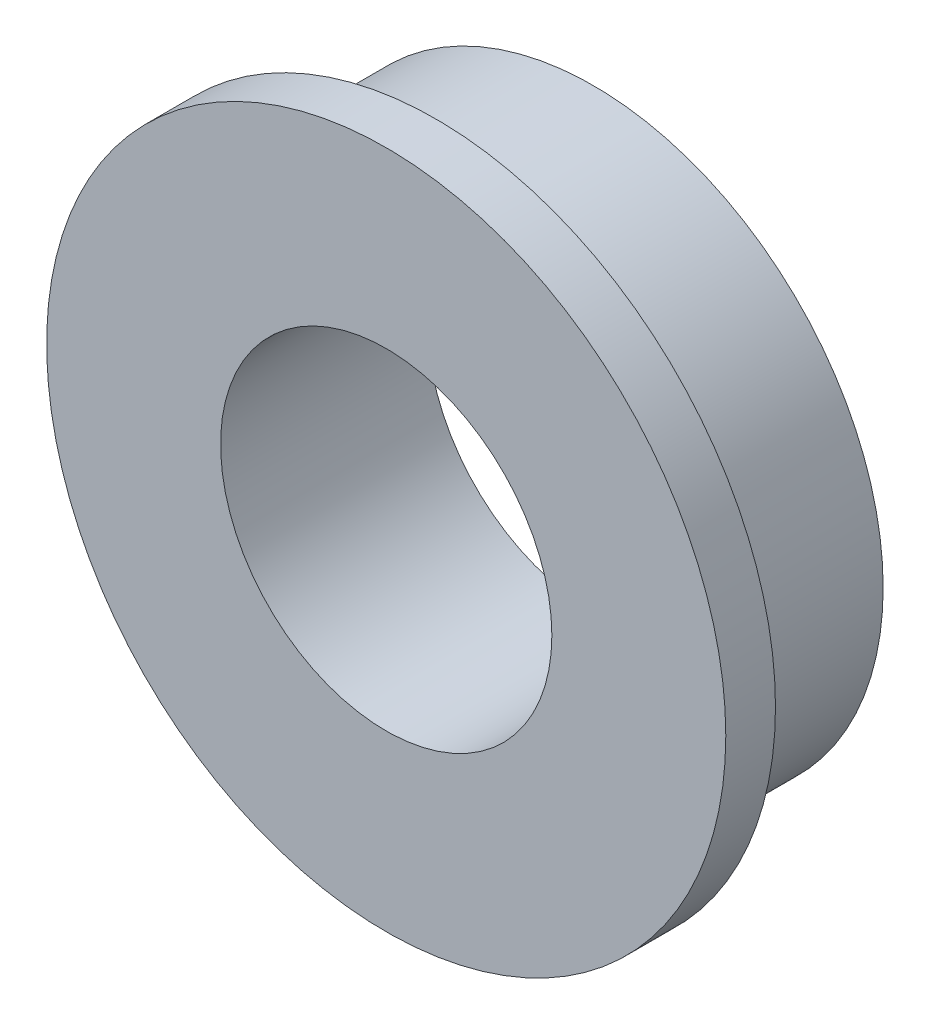
ISO-10303-21;
HEADER;
FILE_DESCRIPTION(('STEP AP214'),'2;1');
FILE_NAME('part.step','',(''),(''),'','','');
FILE_SCHEMA(('AUTOMOTIVE_DESIGN { 1 0 10303 214 1 1 1 1 }'));
ENDSEC;
DATA;
#1=APPLICATION_CONTEXT('core data for automotive mechanical design processes');
#2=APPLICATION_PROTOCOL_DEFINITION('international standard','automotive_design',2000,#1);
#3=PRODUCT_CONTEXT('',#1,'mechanical');
#4=PRODUCT('Part','Part','',(#3));
#5=PRODUCT_RELATED_PRODUCT_CATEGORY('part','',(#4));
#6=PRODUCT_DEFINITION_FORMATION('','',#4);
#7=PRODUCT_DEFINITION_CONTEXT('part definition',#1,'design');
#8=PRODUCT_DEFINITION('design','',#6,#7);
#9=PRODUCT_DEFINITION_SHAPE('','',#8);
#10=(LENGTH_UNIT() NAMED_UNIT(*) SI_UNIT(.MILLI.,.METRE.));
#11=(NAMED_UNIT(*) PLANE_ANGLE_UNIT() SI_UNIT($,.RADIAN.));
#12=(NAMED_UNIT(*) SI_UNIT($,.STERADIAN.) SOLID_ANGLE_UNIT());
#13=UNCERTAINTY_MEASURE_WITH_UNIT(LENGTH_MEASURE(1.E-05),#10,'distance_accuracy_value','');
#14=(GEOMETRIC_REPRESENTATION_CONTEXT(3) GLOBAL_UNCERTAINTY_ASSIGNED_CONTEXT((#13)) GLOBAL_UNIT_ASSIGNED_CONTEXT((#10,
#11,#12)) REPRESENTATION_CONTEXT('',''));
#15=CARTESIAN_POINT('',(0.,0.,0.));
#16=DIRECTION('',(0.,0.,1.));
#17=DIRECTION('',(1.,0.,0.));
#18=AXIS2_PLACEMENT_3D('',#15,#16,#17);
#19=CARTESIAN_POINT('',(0.,0.,0.));
#20=DIRECTION('',(0.,0.,1.));
#21=DIRECTION('',(1.,0.,0.));
#22=AXIS2_PLACEMENT_3D('',#19,#20,#21);
#23=PLANE('',#22);
#24=CARTESIAN_POINT('',(0.,0.,0.));
#25=DIRECTION('',(0.,0.,1.));
#26=DIRECTION('',(1.,0.,0.));
#27=AXIS2_PLACEMENT_3D('',#24,#25,#26);
#28=CIRCLE('',#27,3.5);
#29=CARTESIAN_POINT('',(3.5,0.,0.));
#30=VERTEX_POINT('',#29);
#31=EDGE_CURVE('E37',#30,#30,#28,.T.);
#32=ORIENTED_EDGE('',*,*,#31,.F.);
#33=EDGE_LOOP('',(#32));
#34=FACE_BOUND('',#33,.T.);
#35=CARTESIAN_POINT('',(0.,0.,0.));
#36=DIRECTION('',(0.,0.,1.));
#37=DIRECTION('',(1.,0.,0.));
#38=AXIS2_PLACEMENT_3D('',#35,#36,#37);
#39=CIRCLE('',#38,2.);
#40=CARTESIAN_POINT('',(2.,0.,0.));
#41=VERTEX_POINT('',#40);
#42=EDGE_CURVE('E44',#41,#41,#39,.T.);
#43=ORIENTED_EDGE('',*,*,#42,.T.);
#44=EDGE_LOOP('',(#43));
#45=FACE_BOUND('',#44,.T.);
#46=ADVANCED_FACE('F33',(#34,#45),#23,.F.);
#47=CARTESIAN_POINT('',(0.,0.,1.9));
#48=DIRECTION('',(0.,0.,-1.));
#49=DIRECTION('',(-1.,0.,0.));
#50=AXIS2_PLACEMENT_3D('',#47,#48,#49);
#51=CYLINDRICAL_SURFACE('',#50,3.5);
#52=CARTESIAN_POINT('',(0.,0.,1.9));
#53=DIRECTION('',(0.,0.,1.));
#54=DIRECTION('',(1.,0.,0.));
#55=AXIS2_PLACEMENT_3D('',#52,#53,#54);
#56=CIRCLE('',#55,3.5);
#57=CARTESIAN_POINT('',(3.5,0.,1.9));
#58=VERTEX_POINT('',#57);
#59=EDGE_CURVE('E10',#58,#58,#56,.T.);
#60=ORIENTED_EDGE('',*,*,#59,.F.);
#61=EDGE_LOOP('',(#60));
#62=FACE_BOUND('',#61,.T.);
#63=ORIENTED_EDGE('',*,*,#31,.T.);
#64=EDGE_LOOP('',(#63));
#65=FACE_BOUND('',#64,.T.);
#66=ADVANCED_FACE('F35',(#62,#65),#51,.T.);
#67=CARTESIAN_POINT('',(0.,0.,1.9));
#68=DIRECTION('',(0.,0.,-1.));
#69=DIRECTION('',(-1.,0.,0.));
#70=AXIS2_PLACEMENT_3D('',#67,#68,#69);
#71=CYLINDRICAL_SURFACE('',#70,2.);
#72=ORIENTED_EDGE('',*,*,#42,.F.);
#73=EDGE_LOOP('',(#72));
#74=FACE_BOUND('',#73,.T.);
#75=CARTESIAN_POINT('',(0.,0.,2.5));
#76=DIRECTION('',(0.,0.,1.));
#77=DIRECTION('',(1.,0.,0.));
#78=AXIS2_PLACEMENT_3D('',#75,#76,#77);
#79=CIRCLE('',#78,2.);
#80=CARTESIAN_POINT('',(2.,0.,2.5));
#81=VERTEX_POINT('',#80);
#82=EDGE_CURVE('E52',#81,#81,#79,.T.);
#83=ORIENTED_EDGE('',*,*,#82,.T.);
#84=EDGE_LOOP('',(#83));
#85=FACE_BOUND('',#84,.T.);
#86=ADVANCED_FACE('F58',(#74,#85),#71,.F.);
#87=CARTESIAN_POINT('',(0.,0.,2.5));
#88=DIRECTION('',(0.,0.,1.));
#89=DIRECTION('',(1.,0.,0.));
#90=AXIS2_PLACEMENT_3D('',#87,#88,#89);
#91=PLANE('',#90);
#92=CARTESIAN_POINT('',(0.,0.,2.5));
#93=DIRECTION('',(0.,0.,1.));
#94=DIRECTION('',(1.,0.,0.));
#95=AXIS2_PLACEMENT_3D('',#92,#93,#94);
#96=CIRCLE('',#95,4.1);
#97=CARTESIAN_POINT('',(4.1,0.,2.5));
#98=VERTEX_POINT('',#97);
#99=EDGE_CURVE('E48',#98,#98,#96,.T.);
#100=ORIENTED_EDGE('',*,*,#99,.T.);
#101=EDGE_LOOP('',(#100));
#102=FACE_BOUND('',#101,.T.);
#103=ORIENTED_EDGE('',*,*,#82,.F.);
#104=EDGE_LOOP('',(#103));
#105=FACE_BOUND('',#104,.T.);
#106=ADVANCED_FACE('F60',(#102,#105),#91,.T.);
#107=CARTESIAN_POINT('',(0.,0.,1.9));
#108=DIRECTION('',(0.,0.,1.));
#109=DIRECTION('',(1.,0.,0.));
#110=AXIS2_PLACEMENT_3D('',#107,#108,#109);
#111=PLANE('',#110);
#112=ORIENTED_EDGE('',*,*,#59,.T.);
#113=EDGE_LOOP('',(#112));
#114=FACE_BOUND('',#113,.T.);
#115=CARTESIAN_POINT('',(0.,0.,1.9));
#116=DIRECTION('',(0.,0.,1.));
#117=DIRECTION('',(1.,0.,0.));
#118=AXIS2_PLACEMENT_3D('',#115,#116,#117);
#119=CIRCLE('',#118,4.1);
#120=CARTESIAN_POINT('',(4.1,0.,1.9));
#121=VERTEX_POINT('',#120);
#122=EDGE_CURVE('E49',#121,#121,#119,.T.);
#123=ORIENTED_EDGE('',*,*,#122,.F.);
#124=EDGE_LOOP('',(#123));
#125=FACE_BOUND('',#124,.T.);
#126=ADVANCED_FACE('F62',(#114,#125),#111,.F.);
#127=CARTESIAN_POINT('',(0.,0.,2.5));
#128=DIRECTION('',(0.,0.,-1.));
#129=DIRECTION('',(-1.,0.,0.));
#130=AXIS2_PLACEMENT_3D('',#127,#128,#129);
#131=CYLINDRICAL_SURFACE('',#130,4.1);
#132=ORIENTED_EDGE('',*,*,#99,.F.);
#133=EDGE_LOOP('',(#132));
#134=FACE_BOUND('',#133,.T.);
#135=ORIENTED_EDGE('',*,*,#122,.T.);
#136=EDGE_LOOP('',(#135));
#137=FACE_BOUND('',#136,.T.);
#138=ADVANCED_FACE('F69',(#134,#137),#131,.T.);
#139=CLOSED_SHELL('',(#46,#66,#86,#106,#126,#138));
#140=MANIFOLD_SOLID_BREP('B2',#139);
#141=ADVANCED_BREP_SHAPE_REPRESENTATION('',(#18,#140),#14);
#142=SHAPE_DEFINITION_REPRESENTATION(#9,#141);
ENDSEC;
END-ISO-10303-21;
